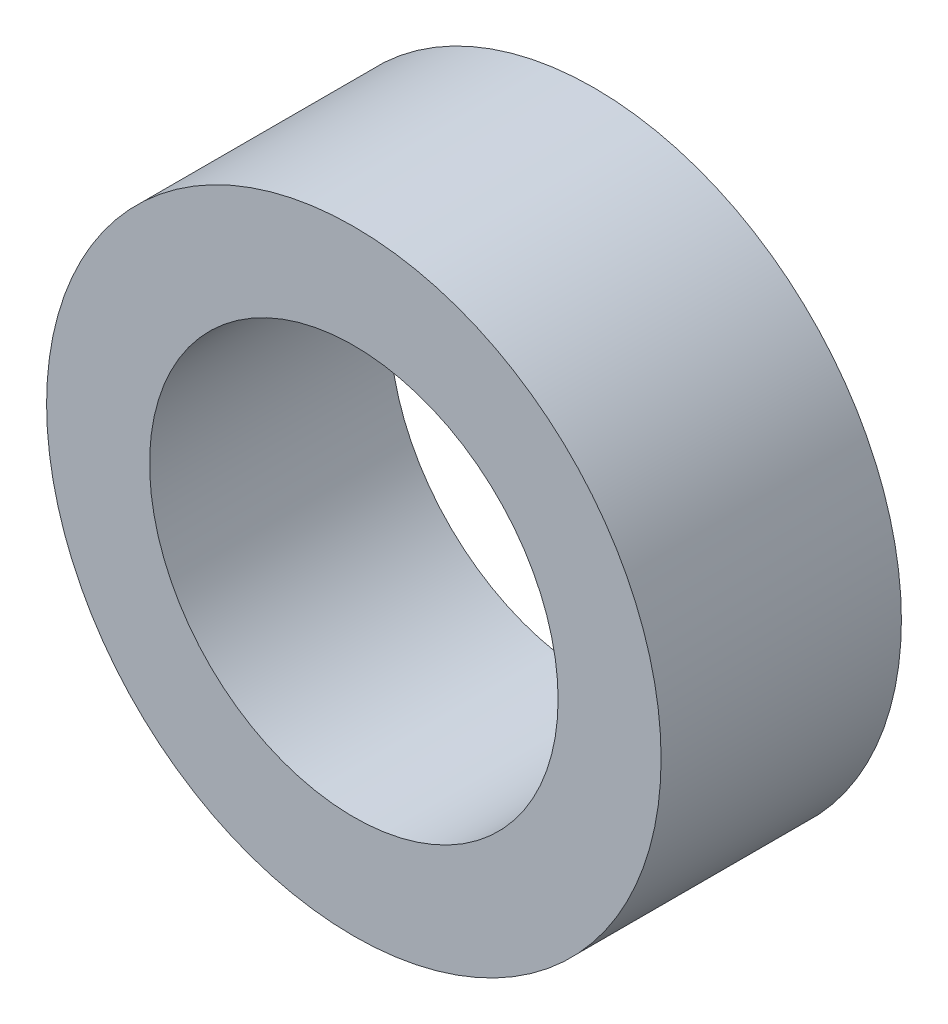
ISO-10303-21;
HEADER;
FILE_DESCRIPTION(('STEP AP214'),'2;1');
FILE_NAME('part.step','',(''),(''),'','','');
FILE_SCHEMA(('AUTOMOTIVE_DESIGN { 1 0 10303 214 1 1 1 1 }'));
ENDSEC;
DATA;
#1=APPLICATION_CONTEXT('core data for automotive mechanical design processes');
#2=APPLICATION_PROTOCOL_DEFINITION('international standard','automotive_design',2000,#1);
#3=PRODUCT_CONTEXT('',#1,'mechanical');
#4=PRODUCT('Part','Part','',(#3));
#5=PRODUCT_RELATED_PRODUCT_CATEGORY('part','',(#4));
#6=PRODUCT_DEFINITION_FORMATION('','',#4);
#7=PRODUCT_DEFINITION_CONTEXT('part definition',#1,'design');
#8=PRODUCT_DEFINITION('design','',#6,#7);
#9=PRODUCT_DEFINITION_SHAPE('','',#8);
#10=(LENGTH_UNIT() NAMED_UNIT(*) SI_UNIT(.MILLI.,.METRE.));
#11=(NAMED_UNIT(*) PLANE_ANGLE_UNIT() SI_UNIT($,.RADIAN.));
#12=(NAMED_UNIT(*) SI_UNIT($,.STERADIAN.) SOLID_ANGLE_UNIT());
#13=UNCERTAINTY_MEASURE_WITH_UNIT(LENGTH_MEASURE(1.E-05),#10,'distance_accuracy_value','');
#14=(GEOMETRIC_REPRESENTATION_CONTEXT(3) GLOBAL_UNCERTAINTY_ASSIGNED_CONTEXT((#13)) GLOBAL_UNIT_ASSIGNED_CONTEXT((#10,
#11,#12)) REPRESENTATION_CONTEXT('',''));
#15=CARTESIAN_POINT('',(0.,0.,0.));
#16=DIRECTION('',(0.,0.,1.));
#17=DIRECTION('',(1.,0.,0.));
#18=AXIS2_PLACEMENT_3D('',#15,#16,#17);
#19=CARTESIAN_POINT('',(0.,0.,7.));
#20=DIRECTION('',(0.,0.,1.));
#21=DIRECTION('',(1.,0.,0.));
#22=AXIS2_PLACEMENT_3D('',#19,#20,#21);
#23=PLANE('',#22);
#24=CARTESIAN_POINT('',(0.,0.,7.));
#25=DIRECTION('',(0.,0.,1.));
#26=DIRECTION('',(1.,0.,0.));
#27=AXIS2_PLACEMENT_3D('',#24,#25,#26);
#28=CIRCLE('',#27,8.95);
#29=CARTESIAN_POINT('',(8.95,0.,7.));
#30=VERTEX_POINT('',#29);
#31=EDGE_CURVE('E11',#30,#30,#28,.T.);
#32=ORIENTED_EDGE('',*,*,#31,.T.);
#33=EDGE_LOOP('',(#32));
#34=FACE_BOUND('',#33,.T.);
#35=CARTESIAN_POINT('',(0.,0.,7.));
#36=DIRECTION('',(0.,0.,1.));
#37=DIRECTION('',(1.,0.,0.));
#38=AXIS2_PLACEMENT_3D('',#35,#36,#37);
#39=CIRCLE('',#38,5.95);
#40=CARTESIAN_POINT('',(5.95,0.,7.));
#41=VERTEX_POINT('',#40);
#42=EDGE_CURVE('E49',#41,#41,#39,.T.);
#43=ORIENTED_EDGE('',*,*,#42,.F.);
#44=EDGE_LOOP('',(#43));
#45=FACE_BOUND('',#44,.T.);
#46=ADVANCED_FACE('F38',(#34,#45),#23,.T.);
#47=CARTESIAN_POINT('',(0.,0.,0.));
#48=DIRECTION('',(0.,0.,1.));
#49=DIRECTION('',(1.,0.,0.));
#50=AXIS2_PLACEMENT_3D('',#47,#48,#49);
#51=PLANE('',#50);
#52=CARTESIAN_POINT('',(0.,0.,0.));
#53=DIRECTION('',(0.,0.,1.));
#54=DIRECTION('',(1.,0.,0.));
#55=AXIS2_PLACEMENT_3D('',#52,#53,#54);
#56=CIRCLE('',#55,8.95);
#57=CARTESIAN_POINT('',(8.95,0.,0.));
#58=VERTEX_POINT('',#57);
#59=EDGE_CURVE('E42',#58,#58,#56,.T.);
#60=ORIENTED_EDGE('',*,*,#59,.F.);
#61=EDGE_LOOP('',(#60));
#62=FACE_BOUND('',#61,.T.);
#63=CARTESIAN_POINT('',(0.,0.,0.));
#64=DIRECTION('',(0.,0.,1.));
#65=DIRECTION('',(1.,0.,0.));
#66=AXIS2_PLACEMENT_3D('',#63,#64,#65);
#67=CIRCLE('',#66,5.95);
#68=CARTESIAN_POINT('',(5.95,0.,0.));
#69=VERTEX_POINT('',#68);
#70=EDGE_CURVE('E51',#69,#69,#67,.T.);
#71=ORIENTED_EDGE('',*,*,#70,.T.);
#72=EDGE_LOOP('',(#71));
#73=FACE_BOUND('',#72,.T.);
#74=ADVANCED_FACE('F61',(#62,#73),#51,.F.);
#75=CARTESIAN_POINT('',(0.,0.,7.));
#76=DIRECTION('',(0.,0.,-1.));
#77=DIRECTION('',(-1.,0.,0.));
#78=AXIS2_PLACEMENT_3D('',#75,#76,#77);
#79=CYLINDRICAL_SURFACE('',#78,8.95);
#80=ORIENTED_EDGE('',*,*,#31,.F.);
#81=EDGE_LOOP('',(#80));
#82=FACE_BOUND('',#81,.T.);
#83=ORIENTED_EDGE('',*,*,#59,.T.);
#84=EDGE_LOOP('',(#83));
#85=FACE_BOUND('',#84,.T.);
#86=ADVANCED_FACE('F40',(#82,#85),#79,.T.);
#87=CARTESIAN_POINT('',(0.,0.,7.));
#88=DIRECTION('',(0.,0.,-1.));
#89=DIRECTION('',(-1.,0.,0.));
#90=AXIS2_PLACEMENT_3D('',#87,#88,#89);
#91=CYLINDRICAL_SURFACE('',#90,5.95);
#92=ORIENTED_EDGE('',*,*,#42,.T.);
#93=EDGE_LOOP('',(#92));
#94=FACE_BOUND('',#93,.T.);
#95=ORIENTED_EDGE('',*,*,#70,.F.);
#96=EDGE_LOOP('',(#95));
#97=FACE_BOUND('',#96,.T.);
#98=ADVANCED_FACE('F57',(#94,#97),#91,.F.);
#99=CLOSED_SHELL('',(#46,#74,#86,#98));
#100=MANIFOLD_SOLID_BREP('B2',#99);
#101=ADVANCED_BREP_SHAPE_REPRESENTATION('',(#18,#100),#14);
#102=SHAPE_DEFINITION_REPRESENTATION(#9,#101);
ENDSEC;
END-ISO-10303-21;
